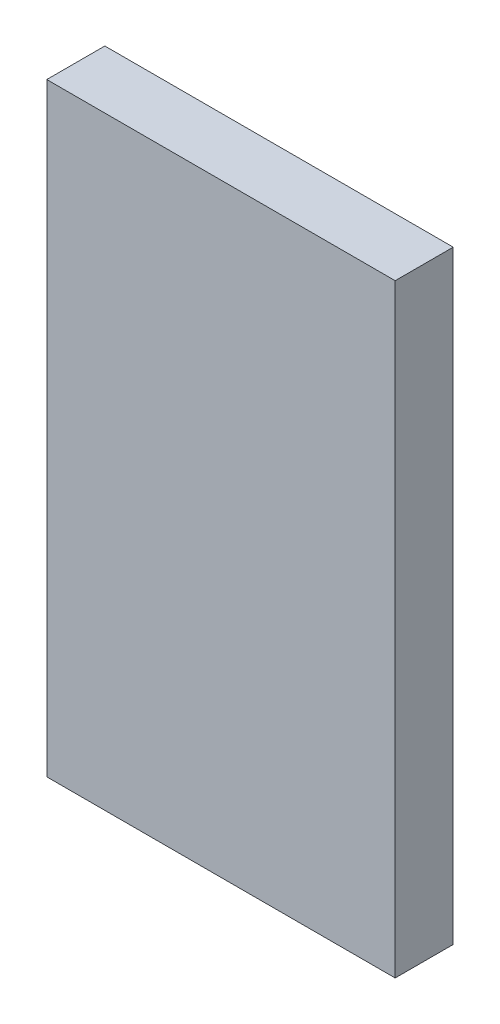
ISO-10303-21;
HEADER;
FILE_DESCRIPTION(('STEP AP214'),'2;1');
FILE_NAME('part.step','',(''),(''),'','','');
FILE_SCHEMA(('AUTOMOTIVE_DESIGN { 1 0 10303 214 1 1 1 1 }'));
ENDSEC;
DATA;
#1=APPLICATION_CONTEXT('core data for automotive mechanical design processes');
#2=APPLICATION_PROTOCOL_DEFINITION('international standard','automotive_design',2000,#1);
#3=PRODUCT_CONTEXT('',#1,'mechanical');
#4=PRODUCT('Part','Part','',(#3));
#5=PRODUCT_RELATED_PRODUCT_CATEGORY('part','',(#4));
#6=PRODUCT_DEFINITION_FORMATION('','',#4);
#7=PRODUCT_DEFINITION_CONTEXT('part definition',#1,'design');
#8=PRODUCT_DEFINITION('design','',#6,#7);
#9=PRODUCT_DEFINITION_SHAPE('','',#8);
#10=(LENGTH_UNIT() NAMED_UNIT(*) SI_UNIT(.MILLI.,.METRE.));
#11=(NAMED_UNIT(*) PLANE_ANGLE_UNIT() SI_UNIT($,.RADIAN.));
#12=(NAMED_UNIT(*) SI_UNIT($,.STERADIAN.) SOLID_ANGLE_UNIT());
#13=UNCERTAINTY_MEASURE_WITH_UNIT(LENGTH_MEASURE(1.E-05),#10,'distance_accuracy_value','');
#14=(GEOMETRIC_REPRESENTATION_CONTEXT(3) GLOBAL_UNCERTAINTY_ASSIGNED_CONTEXT((#13)) GLOBAL_UNIT_ASSIGNED_CONTEXT((#10,
#11,#12)) REPRESENTATION_CONTEXT('',''));
#15=CARTESIAN_POINT('',(0.,0.,0.));
#16=DIRECTION('',(0.,0.,1.));
#17=DIRECTION('',(1.,0.,0.));
#18=AXIS2_PLACEMENT_3D('',#15,#16,#17);
#19=CARTESIAN_POINT('',(0.,0.,2.5));
#20=DIRECTION('',(0.,1.,0.));
#21=DIRECTION('',(0.,0.,1.));
#22=AXIS2_PLACEMENT_3D('',#19,#20,#21);
#23=PLANE('',#22);
#24=DIRECTION('',(1.,0.,0.));
#25=VECTOR('',#24,1.);
#26=CARTESIAN_POINT('',(0.,0.,0.));
#27=LINE('',#26,#25);
#28=CARTESIAN_POINT('',(-15.,0.,0.));
#29=VERTEX_POINT('',#28);
#30=CARTESIAN_POINT('',(0.,0.,0.));
#31=VERTEX_POINT('',#30);
#32=EDGE_CURVE('E106',#29,#31,#27,.T.);
#33=ORIENTED_EDGE('',*,*,#32,.T.);
#34=DIRECTION('',(0.,0.,-1.));
#35=VECTOR('',#34,1.);
#36=CARTESIAN_POINT('',(0.,0.,2.5));
#37=LINE('',#36,#35);
#38=CARTESIAN_POINT('',(0.,0.,2.5));
#39=VERTEX_POINT('',#38);
#40=EDGE_CURVE('E11',#39,#31,#37,.T.);
#41=ORIENTED_EDGE('',*,*,#40,.F.);
#42=DIRECTION('',(1.,0.,0.));
#43=VECTOR('',#42,1.);
#44=CARTESIAN_POINT('',(0.,0.,2.5));
#45=LINE('',#44,#43);
#46=CARTESIAN_POINT('',(-15.,0.,2.5));
#47=VERTEX_POINT('',#46);
#48=EDGE_CURVE('E94',#47,#39,#45,.T.);
#49=ORIENTED_EDGE('',*,*,#48,.F.);
#50=DIRECTION('',(0.,0.,-1.));
#51=VECTOR('',#50,1.);
#52=CARTESIAN_POINT('',(-15.,0.,2.5));
#53=LINE('',#52,#51);
#54=EDGE_CURVE('E102',#47,#29,#53,.T.);
#55=ORIENTED_EDGE('',*,*,#54,.T.);
#56=EDGE_LOOP('',(#33,#41,#49,#55));
#57=FACE_BOUND('',#56,.T.);
#58=ADVANCED_FACE('F43',(#57),#23,.F.);
#59=CARTESIAN_POINT('',(0.,0.,2.5));
#60=DIRECTION('',(-1.,0.,0.));
#61=DIRECTION('',(0.,0.,1.));
#62=AXIS2_PLACEMENT_3D('',#59,#60,#61);
#63=PLANE('',#62);
#64=DIRECTION('',(0.,1.,0.));
#65=VECTOR('',#64,1.);
#66=CARTESIAN_POINT('',(0.,0.,0.));
#67=LINE('',#66,#65);
#68=CARTESIAN_POINT('',(0.,26.,0.));
#69=VERTEX_POINT('',#68);
#70=EDGE_CURVE('E98',#31,#69,#67,.T.);
#71=ORIENTED_EDGE('',*,*,#70,.T.);
#72=DIRECTION('',(0.,0.,-1.));
#73=VECTOR('',#72,1.);
#74=CARTESIAN_POINT('',(0.,26.,2.5));
#75=LINE('',#74,#73);
#76=CARTESIAN_POINT('',(0.,26.,2.5));
#77=VERTEX_POINT('',#76);
#78=EDGE_CURVE('E51',#77,#69,#75,.T.);
#79=ORIENTED_EDGE('',*,*,#78,.F.);
#80=DIRECTION('',(0.,1.,0.));
#81=VECTOR('',#80,1.);
#82=CARTESIAN_POINT('',(0.,0.,2.5));
#83=LINE('',#82,#81);
#84=EDGE_CURVE('E89',#39,#77,#83,.T.);
#85=ORIENTED_EDGE('',*,*,#84,.F.);
#86=ORIENTED_EDGE('',*,*,#40,.T.);
#87=EDGE_LOOP('',(#71,#79,#85,#86));
#88=FACE_BOUND('',#87,.T.);
#89=ADVANCED_FACE('F97',(#88),#63,.F.);
#90=CARTESIAN_POINT('',(0.,26.,2.5));
#91=DIRECTION('',(0.,-1.,0.));
#92=DIRECTION('',(0.,0.,-1.));
#93=AXIS2_PLACEMENT_3D('',#90,#91,#92);
#94=PLANE('',#93);
#95=DIRECTION('',(-1.,0.,0.));
#96=VECTOR('',#95,1.);
#97=CARTESIAN_POINT('',(0.,26.,0.));
#98=LINE('',#97,#96);
#99=CARTESIAN_POINT('',(-15.,26.,0.));
#100=VERTEX_POINT('',#99);
#101=EDGE_CURVE('E76',#69,#100,#98,.T.);
#102=ORIENTED_EDGE('',*,*,#101,.T.);
#103=DIRECTION('',(0.,0.,-1.));
#104=VECTOR('',#103,1.);
#105=CARTESIAN_POINT('',(-15.,26.,2.5));
#106=LINE('',#105,#104);
#107=CARTESIAN_POINT('',(-15.,26.,2.5));
#108=VERTEX_POINT('',#107);
#109=EDGE_CURVE('E99',#108,#100,#106,.T.);
#110=ORIENTED_EDGE('',*,*,#109,.F.);
#111=DIRECTION('',(-1.,0.,0.));
#112=VECTOR('',#111,1.);
#113=CARTESIAN_POINT('',(0.,26.,2.5));
#114=LINE('',#113,#112);
#115=EDGE_CURVE('E92',#77,#108,#114,.T.);
#116=ORIENTED_EDGE('',*,*,#115,.F.);
#117=ORIENTED_EDGE('',*,*,#78,.T.);
#118=EDGE_LOOP('',(#102,#110,#116,#117));
#119=FACE_BOUND('',#118,.T.);
#120=ADVANCED_FACE('F100',(#119),#94,.F.);
#121=CARTESIAN_POINT('',(-15.,0.,2.5));
#122=DIRECTION('',(1.,0.,0.));
#123=DIRECTION('',(0.,0.,-1.));
#124=AXIS2_PLACEMENT_3D('',#121,#122,#123);
#125=PLANE('',#124);
#126=DIRECTION('',(0.,-1.,0.));
#127=VECTOR('',#126,1.);
#128=CARTESIAN_POINT('',(-15.,0.,0.));
#129=LINE('',#128,#127);
#130=EDGE_CURVE('E82',#100,#29,#129,.T.);
#131=ORIENTED_EDGE('',*,*,#130,.T.);
#132=ORIENTED_EDGE('',*,*,#54,.F.);
#133=DIRECTION('',(0.,-1.,0.));
#134=VECTOR('',#133,1.);
#135=CARTESIAN_POINT('',(-15.,0.,2.5));
#136=LINE('',#135,#134);
#137=EDGE_CURVE('E59',#108,#47,#136,.T.);
#138=ORIENTED_EDGE('',*,*,#137,.F.);
#139=ORIENTED_EDGE('',*,*,#109,.T.);
#140=EDGE_LOOP('',(#131,#132,#138,#139));
#141=FACE_BOUND('',#140,.T.);
#142=ADVANCED_FACE('F113',(#141),#125,.F.);
#143=CARTESIAN_POINT('',(0.,0.,2.5));
#144=DIRECTION('',(0.,0.,-1.));
#145=DIRECTION('',(-1.,0.,0.));
#146=AXIS2_PLACEMENT_3D('',#143,#144,#145);
#147=PLANE('',#146);
#148=ORIENTED_EDGE('',*,*,#48,.T.);
#149=ORIENTED_EDGE('',*,*,#84,.T.);
#150=ORIENTED_EDGE('',*,*,#115,.T.);
#151=ORIENTED_EDGE('',*,*,#137,.T.);
#152=EDGE_LOOP('',(#148,#149,#150,#151));
#153=FACE_BOUND('',#152,.T.);
#154=ADVANCED_FACE('F90',(#153),#147,.F.);
#155=CARTESIAN_POINT('',(0.,0.,0.));
#156=DIRECTION('',(0.,0.,-1.));
#157=DIRECTION('',(-1.,0.,0.));
#158=AXIS2_PLACEMENT_3D('',#155,#156,#157);
#159=PLANE('',#158);
#160=ORIENTED_EDGE('',*,*,#32,.F.);
#161=ORIENTED_EDGE('',*,*,#130,.F.);
#162=ORIENTED_EDGE('',*,*,#101,.F.);
#163=ORIENTED_EDGE('',*,*,#70,.F.);
#164=EDGE_LOOP('',(#160,#161,#162,#163));
#165=FACE_BOUND('',#164,.T.);
#166=ADVANCED_FACE('F116',(#165),#159,.T.);
#167=CLOSED_SHELL('',(#58,#89,#120,#142,#154,#166));
#168=MANIFOLD_SOLID_BREP('B2',#167);
#169=ADVANCED_BREP_SHAPE_REPRESENTATION('',(#18,#168),#14);
#170=SHAPE_DEFINITION_REPRESENTATION(#9,#169);
ENDSEC;
END-ISO-10303-21;
